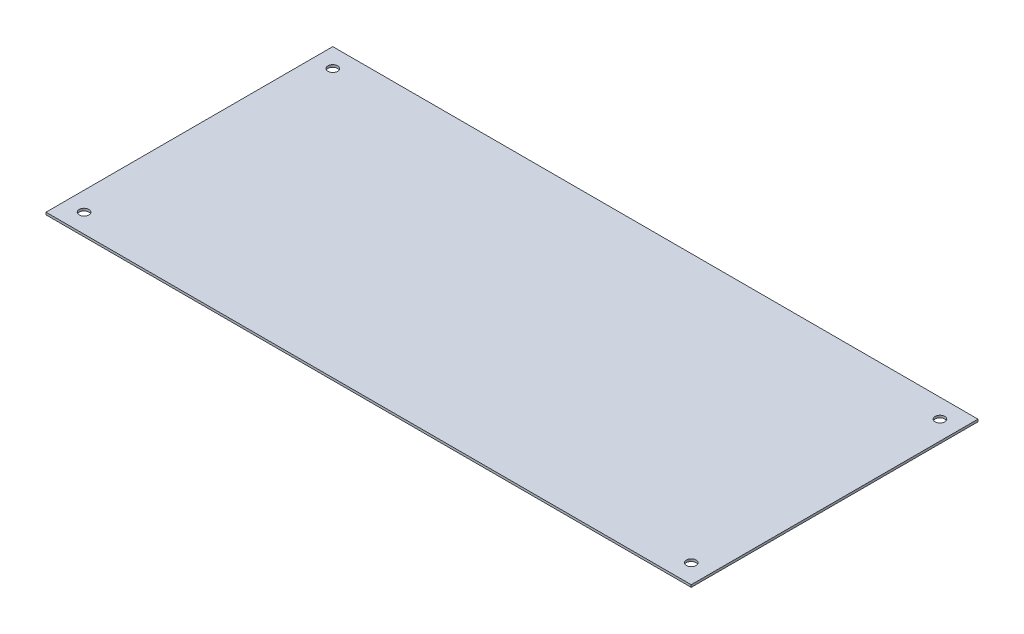
ISO-10303-21;
HEADER;
FILE_DESCRIPTION(('STEP AP214'),'2;1');
FILE_NAME('part.step','',(''),(''),'','','');
FILE_SCHEMA(('AUTOMOTIVE_DESIGN { 1 0 10303 214 1 1 1 1 }'));
ENDSEC;
DATA;
#1=APPLICATION_CONTEXT('core data for automotive mechanical design processes');
#2=APPLICATION_PROTOCOL_DEFINITION('international standard','automotive_design',2000,#1);
#3=PRODUCT_CONTEXT('',#1,'mechanical');
#4=PRODUCT('Part','Part','',(#3));
#5=PRODUCT_RELATED_PRODUCT_CATEGORY('part','',(#4));
#6=PRODUCT_DEFINITION_FORMATION('','',#4);
#7=PRODUCT_DEFINITION_CONTEXT('part definition',#1,'design');
#8=PRODUCT_DEFINITION('design','',#6,#7);
#9=PRODUCT_DEFINITION_SHAPE('','',#8);
#10=(LENGTH_UNIT() NAMED_UNIT(*) SI_UNIT(.MILLI.,.METRE.));
#11=(NAMED_UNIT(*) PLANE_ANGLE_UNIT() SI_UNIT($,.RADIAN.));
#12=(NAMED_UNIT(*) SI_UNIT($,.STERADIAN.) SOLID_ANGLE_UNIT());
#13=UNCERTAINTY_MEASURE_WITH_UNIT(LENGTH_MEASURE(1.E-05),#10,'distance_accuracy_value','');
#14=(GEOMETRIC_REPRESENTATION_CONTEXT(3) GLOBAL_UNCERTAINTY_ASSIGNED_CONTEXT((#13)) GLOBAL_UNIT_ASSIGNED_CONTEXT((#10,
#11,#12)) REPRESENTATION_CONTEXT('',''));
#15=CARTESIAN_POINT('',(0.,0.,0.));
#16=DIRECTION('',(0.,0.,1.));
#17=DIRECTION('',(1.,0.,0.));
#18=AXIS2_PLACEMENT_3D('',#15,#16,#17);
#19=CARTESIAN_POINT('',(-223.,1.6,-96.));
#20=DIRECTION('',(1.,0.,0.));
#21=DIRECTION('',(0.,0.,-1.));
#22=AXIS2_PLACEMENT_3D('',#19,#20,#21);
#23=PLANE('',#22);
#24=DIRECTION('',(0.,0.,1.));
#25=VECTOR('',#24,1.);
#26=CARTESIAN_POINT('',(-223.,0.,-96.));
#27=LINE('',#26,#25);
#28=CARTESIAN_POINT('',(-223.,0.,-96.));
#29=VERTEX_POINT('',#28);
#30=CARTESIAN_POINT('',(-223.,0.,100.));
#31=VERTEX_POINT('',#30);
#32=EDGE_CURVE('E105',#29,#31,#27,.T.);
#33=ORIENTED_EDGE('',*,*,#32,.T.);
#34=DIRECTION('',(0.,-1.,0.));
#35=VECTOR('',#34,1.);
#36=CARTESIAN_POINT('',(-223.,1.6,100.));
#37=LINE('',#36,#35);
#38=CARTESIAN_POINT('',(-223.,1.6,100.));
#39=VERTEX_POINT('',#38);
#40=EDGE_CURVE('E11',#39,#31,#37,.T.);
#41=ORIENTED_EDGE('',*,*,#40,.F.);
#42=DIRECTION('',(0.,0.,1.));
#43=VECTOR('',#42,1.);
#44=CARTESIAN_POINT('',(-223.,1.6,-96.));
#45=LINE('',#44,#43);
#46=CARTESIAN_POINT('',(-223.,1.6,-96.));
#47=VERTEX_POINT('',#46);
#48=EDGE_CURVE('E93',#47,#39,#45,.T.);
#49=ORIENTED_EDGE('',*,*,#48,.F.);
#50=DIRECTION('',(0.,-1.,0.));
#51=VECTOR('',#50,1.);
#52=CARTESIAN_POINT('',(-223.,1.6,-96.));
#53=LINE('',#52,#51);
#54=EDGE_CURVE('E101',#47,#29,#53,.T.);
#55=ORIENTED_EDGE('',*,*,#54,.T.);
#56=EDGE_LOOP('',(#33,#41,#49,#55));
#57=FACE_BOUND('',#56,.T.);
#58=ADVANCED_FACE('F42',(#57),#23,.F.);
#59=CARTESIAN_POINT('',(-223.,1.6,100.));
#60=DIRECTION('',(0.,0.,-1.));
#61=DIRECTION('',(-1.,0.,0.));
#62=AXIS2_PLACEMENT_3D('',#59,#60,#61);
#63=PLANE('',#62);
#64=DIRECTION('',(1.,0.,0.));
#65=VECTOR('',#64,1.);
#66=CARTESIAN_POINT('',(-223.,0.,100.));
#67=LINE('',#66,#65);
#68=CARTESIAN_POINT('',(218.,0.,100.));
#69=VERTEX_POINT('',#68);
#70=EDGE_CURVE('E97',#31,#69,#67,.T.);
#71=ORIENTED_EDGE('',*,*,#70,.T.);
#72=DIRECTION('',(0.,-1.,0.));
#73=VECTOR('',#72,1.);
#74=CARTESIAN_POINT('',(218.,1.6,100.));
#75=LINE('',#74,#73);
#76=CARTESIAN_POINT('',(218.,1.6,100.));
#77=VERTEX_POINT('',#76);
#78=EDGE_CURVE('E50',#77,#69,#75,.T.);
#79=ORIENTED_EDGE('',*,*,#78,.F.);
#80=DIRECTION('',(1.,0.,0.));
#81=VECTOR('',#80,1.);
#82=CARTESIAN_POINT('',(-223.,1.6,100.));
#83=LINE('',#82,#81);
#84=EDGE_CURVE('E88',#39,#77,#83,.T.);
#85=ORIENTED_EDGE('',*,*,#84,.F.);
#86=ORIENTED_EDGE('',*,*,#40,.T.);
#87=EDGE_LOOP('',(#71,#79,#85,#86));
#88=FACE_BOUND('',#87,.T.);
#89=ADVANCED_FACE('F96',(#88),#63,.F.);
#90=CARTESIAN_POINT('',(218.,1.6,-96.));
#91=DIRECTION('',(-1.,0.,0.));
#92=DIRECTION('',(0.,0.,1.));
#93=AXIS2_PLACEMENT_3D('',#90,#91,#92);
#94=PLANE('',#93);
#95=DIRECTION('',(0.,0.,-1.));
#96=VECTOR('',#95,1.);
#97=CARTESIAN_POINT('',(218.,0.,-96.));
#98=LINE('',#97,#96);
#99=CARTESIAN_POINT('',(218.,0.,-96.));
#100=VERTEX_POINT('',#99);
#101=EDGE_CURVE('E75',#69,#100,#98,.T.);
#102=ORIENTED_EDGE('',*,*,#101,.T.);
#103=DIRECTION('',(0.,-1.,0.));
#104=VECTOR('',#103,1.);
#105=CARTESIAN_POINT('',(218.,1.6,-96.));
#106=LINE('',#105,#104);
#107=CARTESIAN_POINT('',(218.,1.6,-96.));
#108=VERTEX_POINT('',#107);
#109=EDGE_CURVE('E98',#108,#100,#106,.T.);
#110=ORIENTED_EDGE('',*,*,#109,.F.);
#111=DIRECTION('',(0.,0.,-1.));
#112=VECTOR('',#111,1.);
#113=CARTESIAN_POINT('',(218.,1.6,-96.));
#114=LINE('',#113,#112);
#115=EDGE_CURVE('E91',#77,#108,#114,.T.);
#116=ORIENTED_EDGE('',*,*,#115,.F.);
#117=ORIENTED_EDGE('',*,*,#78,.T.);
#118=EDGE_LOOP('',(#102,#110,#116,#117));
#119=FACE_BOUND('',#118,.T.);
#120=ADVANCED_FACE('F99',(#119),#94,.F.);
#121=CARTESIAN_POINT('',(-223.,1.6,-96.));
#122=DIRECTION('',(0.,0.,1.));
#123=DIRECTION('',(1.,0.,0.));
#124=AXIS2_PLACEMENT_3D('',#121,#122,#123);
#125=PLANE('',#124);
#126=DIRECTION('',(-1.,0.,0.));
#127=VECTOR('',#126,1.);
#128=CARTESIAN_POINT('',(-223.,0.,-96.));
#129=LINE('',#128,#127);
#130=EDGE_CURVE('E81',#100,#29,#129,.T.);
#131=ORIENTED_EDGE('',*,*,#130,.T.);
#132=ORIENTED_EDGE('',*,*,#54,.F.);
#133=DIRECTION('',(-1.,0.,0.));
#134=VECTOR('',#133,1.);
#135=CARTESIAN_POINT('',(-223.,1.6,-96.));
#136=LINE('',#135,#134);
#137=EDGE_CURVE('E58',#108,#47,#136,.T.);
#138=ORIENTED_EDGE('',*,*,#137,.F.);
#139=ORIENTED_EDGE('',*,*,#109,.T.);
#140=EDGE_LOOP('',(#131,#132,#138,#139));
#141=FACE_BOUND('',#140,.T.);
#142=ADVANCED_FACE('F113',(#141),#125,.F.);
#143=CARTESIAN_POINT('',(0.,1.6,0.));
#144=DIRECTION('',(0.,1.,0.));
#145=DIRECTION('',(0.,0.,1.));
#146=AXIS2_PLACEMENT_3D('',#143,#144,#145);
#147=PLANE('',#146);
#148=CARTESIAN_POINT('',(-210.,1.6,87.0000000000001));
#149=DIRECTION('',(0.,1.,0.));
#150=DIRECTION('',(0.,0.,-1.));
#151=AXIS2_PLACEMENT_3D('',#148,#149,#150);
#152=CIRCLE('',#151,3.3);
#153=CARTESIAN_POINT('',(-210.,1.6,83.7000000000001));
#154=VERTEX_POINT('',#153);
#155=EDGE_CURVE('E128',#154,#154,#152,.T.);
#156=ORIENTED_EDGE('',*,*,#155,.F.);
#157=EDGE_LOOP('',(#156));
#158=FACE_BOUND('',#157,.T.);
#159=CARTESIAN_POINT('',(205.,1.6,87.0000000000001));
#160=DIRECTION('',(0.,1.,0.));
#161=DIRECTION('',(0.,0.,1.));
#162=AXIS2_PLACEMENT_3D('',#159,#160,#161);
#163=CIRCLE('',#162,3.3);
#164=CARTESIAN_POINT('',(205.,1.6,90.3000000000001));
#165=VERTEX_POINT('',#164);
#166=EDGE_CURVE('E134',#165,#165,#163,.T.);
#167=ORIENTED_EDGE('',*,*,#166,.F.);
#168=EDGE_LOOP('',(#167));
#169=FACE_BOUND('',#168,.T.);
#170=CARTESIAN_POINT('',(205.,1.6,-83.0000000000001));
#171=DIRECTION('',(0.,1.,0.));
#172=DIRECTION('',(0.,0.,-1.));
#173=AXIS2_PLACEMENT_3D('',#170,#171,#172);
#174=CIRCLE('',#173,3.3);
#175=CARTESIAN_POINT('',(205.,1.6,-86.3000000000001));
#176=VERTEX_POINT('',#175);
#177=EDGE_CURVE('E122',#176,#176,#174,.T.);
#178=ORIENTED_EDGE('',*,*,#177,.F.);
#179=EDGE_LOOP('',(#178));
#180=FACE_BOUND('',#179,.T.);
#181=CARTESIAN_POINT('',(-210.,1.6,-83.));
#182=DIRECTION('',(0.,1.,0.));
#183=DIRECTION('',(0.,0.,1.));
#184=AXIS2_PLACEMENT_3D('',#181,#182,#183);
#185=CIRCLE('',#184,3.3);
#186=CARTESIAN_POINT('',(-210.,1.6,-79.7));
#187=VERTEX_POINT('',#186);
#188=EDGE_CURVE('E119',#187,#187,#185,.T.);
#189=ORIENTED_EDGE('',*,*,#188,.F.);
#190=EDGE_LOOP('',(#189));
#191=FACE_BOUND('',#190,.T.);
#192=ORIENTED_EDGE('',*,*,#48,.T.);
#193=ORIENTED_EDGE('',*,*,#84,.T.);
#194=ORIENTED_EDGE('',*,*,#115,.T.);
#195=ORIENTED_EDGE('',*,*,#137,.T.);
#196=EDGE_LOOP('',(#192,#193,#194,#195));
#197=FACE_BOUND('',#196,.T.);
#198=ADVANCED_FACE('F89',(#158,#169,#180,#191,#197),#147,.T.);
#199=CARTESIAN_POINT('',(0.,0.,0.));
#200=DIRECTION('',(0.,1.,0.));
#201=DIRECTION('',(0.,0.,1.));
#202=AXIS2_PLACEMENT_3D('',#199,#200,#201);
#203=PLANE('',#202);
#204=CARTESIAN_POINT('',(-210.,0.,87.0000000000001));
#205=DIRECTION('',(0.,1.,0.));
#206=DIRECTION('',(0.,0.,-1.));
#207=AXIS2_PLACEMENT_3D('',#204,#205,#206);
#208=CIRCLE('',#207,3.3);
#209=CARTESIAN_POINT('',(-210.,0.,83.7000000000001));
#210=VERTEX_POINT('',#209);
#211=EDGE_CURVE('E125',#210,#210,#208,.T.);
#212=ORIENTED_EDGE('',*,*,#211,.T.);
#213=EDGE_LOOP('',(#212));
#214=FACE_BOUND('',#213,.T.);
#215=CARTESIAN_POINT('',(205.,0.,87.0000000000001));
#216=DIRECTION('',(0.,1.,0.));
#217=DIRECTION('',(0.,0.,1.));
#218=AXIS2_PLACEMENT_3D('',#215,#216,#217);
#219=CIRCLE('',#218,3.3);
#220=CARTESIAN_POINT('',(205.,0.,90.3000000000001));
#221=VERTEX_POINT('',#220);
#222=EDGE_CURVE('E131',#221,#221,#219,.T.);
#223=ORIENTED_EDGE('',*,*,#222,.T.);
#224=EDGE_LOOP('',(#223));
#225=FACE_BOUND('',#224,.T.);
#226=CARTESIAN_POINT('',(205.,0.,-83.0000000000001));
#227=DIRECTION('',(0.,1.,0.));
#228=DIRECTION('',(0.,0.,-1.));
#229=AXIS2_PLACEMENT_3D('',#226,#227,#228);
#230=CIRCLE('',#229,3.3);
#231=CARTESIAN_POINT('',(205.,0.,-86.3000000000001));
#232=VERTEX_POINT('',#231);
#233=EDGE_CURVE('E137',#232,#232,#230,.T.);
#234=ORIENTED_EDGE('',*,*,#233,.T.);
#235=EDGE_LOOP('',(#234));
#236=FACE_BOUND('',#235,.T.);
#237=CARTESIAN_POINT('',(-210.,0.,-83.));
#238=DIRECTION('',(0.,1.,0.));
#239=DIRECTION('',(0.,0.,1.));
#240=AXIS2_PLACEMENT_3D('',#237,#238,#239);
#241=CIRCLE('',#240,3.3);
#242=CARTESIAN_POINT('',(-210.,0.,-79.7));
#243=VERTEX_POINT('',#242);
#244=EDGE_CURVE('E108',#243,#243,#241,.T.);
#245=ORIENTED_EDGE('',*,*,#244,.T.);
#246=EDGE_LOOP('',(#245));
#247=FACE_BOUND('',#246,.T.);
#248=ORIENTED_EDGE('',*,*,#32,.F.);
#249=ORIENTED_EDGE('',*,*,#130,.F.);
#250=ORIENTED_EDGE('',*,*,#101,.F.);
#251=ORIENTED_EDGE('',*,*,#70,.F.);
#252=EDGE_LOOP('',(#248,#249,#250,#251));
#253=FACE_BOUND('',#252,.T.);
#254=ADVANCED_FACE('F116',(#214,#225,#236,#247,#253),#203,.F.);
#255=CARTESIAN_POINT('',(-210.,0.,-83.));
#256=DIRECTION('',(0.,1.,0.));
#257=DIRECTION('',(0.,0.,1.));
#258=AXIS2_PLACEMENT_3D('',#255,#256,#257);
#259=CYLINDRICAL_SURFACE('',#258,3.3);
#260=ORIENTED_EDGE('',*,*,#244,.F.);
#261=EDGE_LOOP('',(#260));
#262=FACE_BOUND('',#261,.T.);
#263=ORIENTED_EDGE('',*,*,#188,.T.);
#264=EDGE_LOOP('',(#263));
#265=FACE_BOUND('',#264,.T.);
#266=ADVANCED_FACE('F151',(#262,#265),#259,.F.);
#267=CARTESIAN_POINT('',(205.,0.,-83.0000000000001));
#268=DIRECTION('',(0.,1.,0.));
#269=DIRECTION('',(0.,0.,1.));
#270=AXIS2_PLACEMENT_3D('',#267,#268,#269);
#271=CYLINDRICAL_SURFACE('',#270,3.3);
#272=ORIENTED_EDGE('',*,*,#233,.F.);
#273=EDGE_LOOP('',(#272));
#274=FACE_BOUND('',#273,.T.);
#275=ORIENTED_EDGE('',*,*,#177,.T.);
#276=EDGE_LOOP('',(#275));
#277=FACE_BOUND('',#276,.T.);
#278=ADVANCED_FACE('F143',(#274,#277),#271,.F.);
#279=CARTESIAN_POINT('',(205.,0.,87.0000000000001));
#280=DIRECTION('',(0.,1.,0.));
#281=DIRECTION('',(0.,0.,1.));
#282=AXIS2_PLACEMENT_3D('',#279,#280,#281);
#283=CYLINDRICAL_SURFACE('',#282,3.3);
#284=ORIENTED_EDGE('',*,*,#222,.F.);
#285=EDGE_LOOP('',(#284));
#286=FACE_BOUND('',#285,.T.);
#287=ORIENTED_EDGE('',*,*,#166,.T.);
#288=EDGE_LOOP('',(#287));
#289=FACE_BOUND('',#288,.T.);
#290=ADVANCED_FACE('F159',(#286,#289),#283,.F.);
#291=CARTESIAN_POINT('',(-210.,0.,87.0000000000001));
#292=DIRECTION('',(0.,1.,0.));
#293=DIRECTION('',(0.,0.,1.));
#294=AXIS2_PLACEMENT_3D('',#291,#292,#293);
#295=CYLINDRICAL_SURFACE('',#294,3.3);
#296=ORIENTED_EDGE('',*,*,#211,.F.);
#297=EDGE_LOOP('',(#296));
#298=FACE_BOUND('',#297,.T.);
#299=ORIENTED_EDGE('',*,*,#155,.T.);
#300=EDGE_LOOP('',(#299));
#301=FACE_BOUND('',#300,.T.);
#302=ADVANCED_FACE('F208',(#298,#301),#295,.F.);
#303=CLOSED_SHELL('',(#58,#89,#120,#142,#198,#254,#266,#278,#290,#302));
#304=MANIFOLD_SOLID_BREP('B2',#303);
#305=ADVANCED_BREP_SHAPE_REPRESENTATION('',(#18,#304),#14);
#306=SHAPE_DEFINITION_REPRESENTATION(#9,#305);
ENDSEC;
END-ISO-10303-21;
